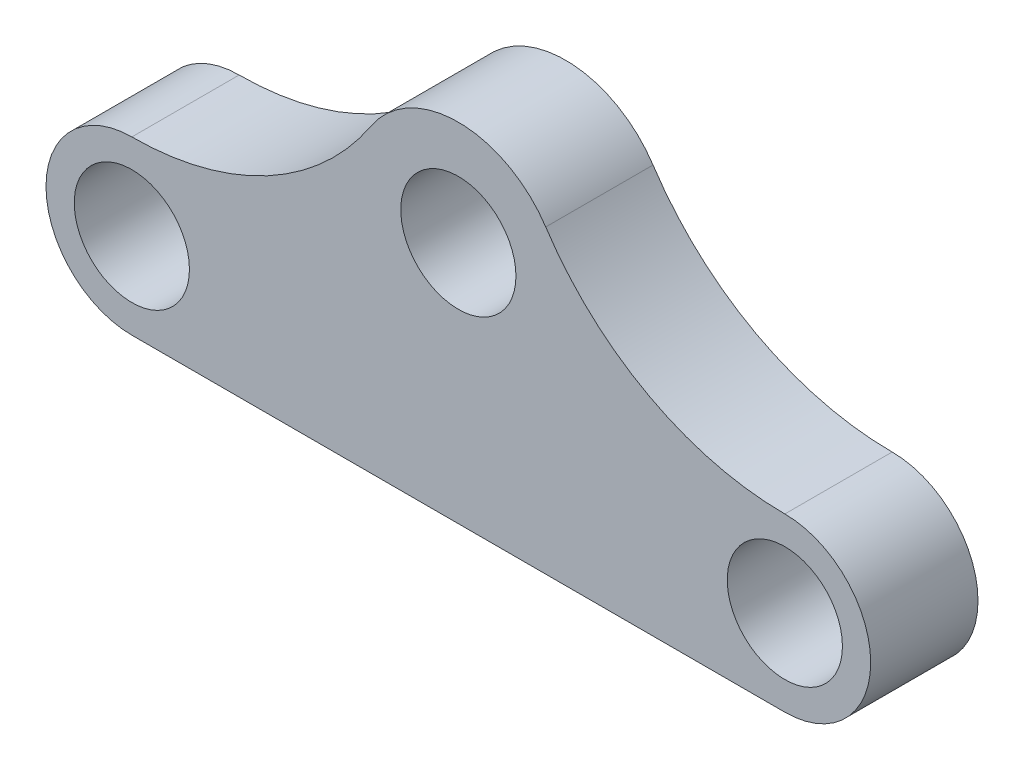
ISO-10303-21;
HEADER;
FILE_DESCRIPTION(('STEP AP214'),'2;1');
FILE_NAME('part.step','',(''),(''),'','','');
FILE_SCHEMA(('AUTOMOTIVE_DESIGN { 1 0 10303 214 1 1 1 1 }'));
ENDSEC;
DATA;
#1=APPLICATION_CONTEXT('core data for automotive mechanical design processes');
#2=APPLICATION_PROTOCOL_DEFINITION('international standard','automotive_design',2000,#1);
#3=PRODUCT_CONTEXT('',#1,'mechanical');
#4=PRODUCT('Part','Part','',(#3));
#5=PRODUCT_RELATED_PRODUCT_CATEGORY('part','',(#4));
#6=PRODUCT_DEFINITION_FORMATION('','',#4);
#7=PRODUCT_DEFINITION_CONTEXT('part definition',#1,'design');
#8=PRODUCT_DEFINITION('design','',#6,#7);
#9=PRODUCT_DEFINITION_SHAPE('','',#8);
#10=(LENGTH_UNIT() NAMED_UNIT(*) SI_UNIT(.MILLI.,.METRE.));
#11=(NAMED_UNIT(*) PLANE_ANGLE_UNIT() SI_UNIT($,.RADIAN.));
#12=(NAMED_UNIT(*) SI_UNIT($,.STERADIAN.) SOLID_ANGLE_UNIT());
#13=UNCERTAINTY_MEASURE_WITH_UNIT(LENGTH_MEASURE(1.E-05),#10,'distance_accuracy_value','');
#14=(GEOMETRIC_REPRESENTATION_CONTEXT(3) GLOBAL_UNCERTAINTY_ASSIGNED_CONTEXT((#13)) GLOBAL_UNIT_ASSIGNED_CONTEXT((#10,
#11,#12)) REPRESENTATION_CONTEXT('',''));
#15=CARTESIAN_POINT('',(0.,0.,0.));
#16=DIRECTION('',(0.,0.,1.));
#17=DIRECTION('',(1.,0.,0.));
#18=AXIS2_PLACEMENT_3D('',#15,#16,#17);
#19=CARTESIAN_POINT('',(22.82,11.,7.5));
#20=DIRECTION('',(0.,0.,-1.));
#21=DIRECTION('',(-1.,0.,0.));
#22=AXIS2_PLACEMENT_3D('',#19,#20,#21);
#23=CYLINDRICAL_SURFACE('',#22,7.30846755129258);
#24=CARTESIAN_POINT('',(22.82,11.,0.));
#25=DIRECTION('',(0.,0.,1.));
#26=DIRECTION('',(1.,0.,0.));
#27=AXIS2_PLACEMENT_3D('',#24,#25,#26);
#28=CIRCLE('',#27,7.30846755129258);
#29=CARTESIAN_POINT('',(16.7127649745545,15.0143963795654,0.));
#30=VERTEX_POINT('',#29);
#31=CARTESIAN_POINT('',(28.9272350254455,15.0143963795654,0.));
#32=VERTEX_POINT('',#31);
#33=EDGE_CURVE('E137',#30,#32,#28,.F.);
#34=ORIENTED_EDGE('',*,*,#33,.F.);
#35=DIRECTION('',(0.,0.,-1.));
#36=VECTOR('',#35,1.);
#37=CARTESIAN_POINT('',(16.7127649745545,15.0143963795654,7.5));
#38=LINE('',#37,#36);
#39=CARTESIAN_POINT('',(16.7127649745545,15.0143963795654,7.5));
#40=VERTEX_POINT('',#39);
#41=EDGE_CURVE('E11',#40,#30,#38,.T.);
#42=ORIENTED_EDGE('',*,*,#41,.F.);
#43=CARTESIAN_POINT('',(22.82,11.,7.5));
#44=DIRECTION('',(0.,0.,1.));
#45=DIRECTION('',(1.,0.,0.));
#46=AXIS2_PLACEMENT_3D('',#43,#44,#45);
#47=CIRCLE('',#46,7.30846755129258);
#48=CARTESIAN_POINT('',(28.9272350254455,15.0143963795654,7.5));
#49=VERTEX_POINT('',#48);
#50=EDGE_CURVE('E201',#40,#49,#47,.F.);
#51=ORIENTED_EDGE('',*,*,#50,.T.);
#52=DIRECTION('',(0.,0.,-1.));
#53=VECTOR('',#52,1.);
#54=CARTESIAN_POINT('',(28.9272350254455,15.0143963795654,7.5));
#55=LINE('',#54,#53);
#56=EDGE_CURVE('E83',#49,#32,#55,.T.);
#57=ORIENTED_EDGE('',*,*,#56,.T.);
#58=EDGE_LOOP('',(#34,#42,#51,#57));
#59=FACE_BOUND('',#58,.T.);
#60=ADVANCED_FACE('F38',(#59),#23,.T.);
#61=CARTESIAN_POINT('',(0.,26.,7.5));
#62=DIRECTION('',(0.,0.,-1.));
#63=DIRECTION('',(-1.,0.,0.));
#64=AXIS2_PLACEMENT_3D('',#61,#62,#63);
#65=CYLINDRICAL_SURFACE('',#64,20.);
#66=CARTESIAN_POINT('',(0.,26.,0.));
#67=DIRECTION('',(0.,0.,1.));
#68=DIRECTION('',(1.,0.,0.));
#69=AXIS2_PLACEMENT_3D('',#66,#67,#68);
#70=CIRCLE('',#69,20.);
#71=CARTESIAN_POINT('',(0.,6.,0.));
#72=VERTEX_POINT('',#71);
#73=EDGE_CURVE('E134',#72,#30,#70,.T.);
#74=ORIENTED_EDGE('',*,*,#73,.F.);
#75=DIRECTION('',(0.,0.,-1.));
#76=VECTOR('',#75,1.);
#77=CARTESIAN_POINT('',(0.,6.,7.5));
#78=LINE('',#77,#76);
#79=CARTESIAN_POINT('',(0.,6.,7.5));
#80=VERTEX_POINT('',#79);
#81=EDGE_CURVE('E47',#80,#72,#78,.T.);
#82=ORIENTED_EDGE('',*,*,#81,.F.);
#83=CARTESIAN_POINT('',(0.,26.,7.5));
#84=DIRECTION('',(0.,0.,1.));
#85=DIRECTION('',(1.,0.,0.));
#86=AXIS2_PLACEMENT_3D('',#83,#84,#85);
#87=CIRCLE('',#86,20.);
#88=EDGE_CURVE('E203',#80,#40,#87,.T.);
#89=ORIENTED_EDGE('',*,*,#88,.T.);
#90=ORIENTED_EDGE('',*,*,#41,.T.);
#91=EDGE_LOOP('',(#74,#82,#89,#90));
#92=FACE_BOUND('',#91,.T.);
#93=ADVANCED_FACE('F136',(#92),#65,.F.);
#94=CARTESIAN_POINT('',(0.,0.,7.5));
#95=DIRECTION('',(0.,0.,-1.));
#96=DIRECTION('',(-1.,0.,0.));
#97=AXIS2_PLACEMENT_3D('',#94,#95,#96);
#98=CYLINDRICAL_SURFACE('',#97,6.);
#99=CARTESIAN_POINT('',(0.,0.,0.));
#100=DIRECTION('',(0.,0.,1.));
#101=DIRECTION('',(1.,0.,0.));
#102=AXIS2_PLACEMENT_3D('',#99,#100,#101);
#103=CIRCLE('',#102,6.);
#104=CARTESIAN_POINT('',(0.,-6.,0.));
#105=VERTEX_POINT('',#104);
#106=EDGE_CURVE('E127',#72,#105,#103,.T.);
#107=ORIENTED_EDGE('',*,*,#106,.T.);
#108=DIRECTION('',(0.,0.,-1.));
#109=VECTOR('',#108,1.);
#110=CARTESIAN_POINT('',(0.,-6.,7.5));
#111=LINE('',#110,#109);
#112=CARTESIAN_POINT('',(0.,-6.,7.5));
#113=VERTEX_POINT('',#112);
#114=EDGE_CURVE('E118',#113,#105,#111,.T.);
#115=ORIENTED_EDGE('',*,*,#114,.F.);
#116=CARTESIAN_POINT('',(0.,0.,7.5));
#117=DIRECTION('',(0.,0.,1.));
#118=DIRECTION('',(1.,0.,0.));
#119=AXIS2_PLACEMENT_3D('',#116,#117,#118);
#120=CIRCLE('',#119,6.);
#121=EDGE_CURVE('E111',#80,#113,#120,.T.);
#122=ORIENTED_EDGE('',*,*,#121,.F.);
#123=ORIENTED_EDGE('',*,*,#81,.T.);
#124=EDGE_LOOP('',(#107,#115,#122,#123));
#125=FACE_BOUND('',#124,.T.);
#126=ADVANCED_FACE('F126',(#125),#98,.T.);
#127=CARTESIAN_POINT('',(0.,-6.,7.5));
#128=DIRECTION('',(0.,1.,0.));
#129=DIRECTION('',(-1.,0.,0.));
#130=AXIS2_PLACEMENT_3D('',#127,#128,#129);
#131=PLANE('',#130);
#132=DIRECTION('',(1.,0.,0.));
#133=VECTOR('',#132,1.);
#134=CARTESIAN_POINT('',(0.,-6.,0.));
#135=LINE('',#134,#133);
#136=CARTESIAN_POINT('',(45.64,-6.,0.));
#137=VERTEX_POINT('',#136);
#138=EDGE_CURVE('E117',#105,#137,#135,.T.);
#139=ORIENTED_EDGE('',*,*,#138,.T.);
#140=DIRECTION('',(0.,0.,-1.));
#141=VECTOR('',#140,1.);
#142=CARTESIAN_POINT('',(45.64,-6.,7.5));
#143=LINE('',#142,#141);
#144=CARTESIAN_POINT('',(45.64,-6.,7.5));
#145=VERTEX_POINT('',#144);
#146=EDGE_CURVE('E101',#145,#137,#143,.T.);
#147=ORIENTED_EDGE('',*,*,#146,.F.);
#148=DIRECTION('',(1.,0.,0.));
#149=VECTOR('',#148,1.);
#150=CARTESIAN_POINT('',(0.,-6.,7.5));
#151=LINE('',#150,#149);
#152=EDGE_CURVE('E104',#113,#145,#151,.T.);
#153=ORIENTED_EDGE('',*,*,#152,.F.);
#154=ORIENTED_EDGE('',*,*,#114,.T.);
#155=EDGE_LOOP('',(#139,#147,#153,#154));
#156=FACE_BOUND('',#155,.T.);
#157=ADVANCED_FACE('F116',(#156),#131,.F.);
#158=CARTESIAN_POINT('',(45.64,0.,7.5));
#159=DIRECTION('',(0.,0.,-1.));
#160=DIRECTION('',(-1.,0.,0.));
#161=AXIS2_PLACEMENT_3D('',#158,#159,#160);
#162=CYLINDRICAL_SURFACE('',#161,6.);
#163=CARTESIAN_POINT('',(45.64,0.,0.));
#164=DIRECTION('',(0.,0.,1.));
#165=DIRECTION('',(1.,0.,0.));
#166=AXIS2_PLACEMENT_3D('',#163,#164,#165);
#167=CIRCLE('',#166,6.);
#168=CARTESIAN_POINT('',(45.64,6.,0.));
#169=VERTEX_POINT('',#168);
#170=EDGE_CURVE('E144',#137,#169,#167,.T.);
#171=ORIENTED_EDGE('',*,*,#170,.T.);
#172=DIRECTION('',(0.,0.,-1.));
#173=VECTOR('',#172,1.);
#174=CARTESIAN_POINT('',(45.64,6.,7.5));
#175=LINE('',#174,#173);
#176=CARTESIAN_POINT('',(45.64,6.,7.5));
#177=VERTEX_POINT('',#176);
#178=EDGE_CURVE('E103',#177,#169,#175,.T.);
#179=ORIENTED_EDGE('',*,*,#178,.F.);
#180=CARTESIAN_POINT('',(45.64,0.,7.5));
#181=DIRECTION('',(0.,0.,1.));
#182=DIRECTION('',(1.,0.,0.));
#183=AXIS2_PLACEMENT_3D('',#180,#181,#182);
#184=CIRCLE('',#183,6.);
#185=EDGE_CURVE('E96',#145,#177,#184,.T.);
#186=ORIENTED_EDGE('',*,*,#185,.F.);
#187=ORIENTED_EDGE('',*,*,#146,.T.);
#188=EDGE_LOOP('',(#171,#179,#186,#187));
#189=FACE_BOUND('',#188,.T.);
#190=ADVANCED_FACE('F99',(#189),#162,.T.);
#191=CARTESIAN_POINT('',(45.64,0.,7.5));
#192=DIRECTION('',(0.,0.,-1.));
#193=DIRECTION('',(-1.,0.,0.));
#194=AXIS2_PLACEMENT_3D('',#191,#192,#193);
#195=CYLINDRICAL_SURFACE('',#194,4.025);
#196=CARTESIAN_POINT('',(45.64,0.,7.5));
#197=DIRECTION('',(0.,0.,1.));
#198=DIRECTION('',(1.,0.,0.));
#199=AXIS2_PLACEMENT_3D('',#196,#197,#198);
#200=CIRCLE('',#199,4.025);
#201=CARTESIAN_POINT('',(49.665,0.,7.5));
#202=VERTEX_POINT('',#201);
#203=EDGE_CURVE('E155',#202,#202,#200,.T.);
#204=ORIENTED_EDGE('',*,*,#203,.T.);
#205=EDGE_LOOP('',(#204));
#206=FACE_BOUND('',#205,.T.);
#207=CARTESIAN_POINT('',(45.64,0.,0.));
#208=DIRECTION('',(0.,0.,1.));
#209=DIRECTION('',(1.,0.,0.));
#210=AXIS2_PLACEMENT_3D('',#207,#208,#209);
#211=CIRCLE('',#210,4.025);
#212=CARTESIAN_POINT('',(49.665,0.,0.));
#213=VERTEX_POINT('',#212);
#214=EDGE_CURVE('E147',#213,#213,#211,.T.);
#215=ORIENTED_EDGE('',*,*,#214,.F.);
#216=EDGE_LOOP('',(#215));
#217=FACE_BOUND('',#216,.T.);
#218=ADVANCED_FACE('F175',(#206,#217),#195,.F.);
#219=CARTESIAN_POINT('',(45.64,26.,7.5));
#220=DIRECTION('',(0.,0.,-1.));
#221=DIRECTION('',(-1.,0.,0.));
#222=AXIS2_PLACEMENT_3D('',#219,#220,#221);
#223=CYLINDRICAL_SURFACE('',#222,20.);
#224=CARTESIAN_POINT('',(45.64,26.,0.));
#225=DIRECTION('',(0.,0.,1.));
#226=DIRECTION('',(1.,0.,0.));
#227=AXIS2_PLACEMENT_3D('',#224,#225,#226);
#228=CIRCLE('',#227,20.);
#229=EDGE_CURVE('E76',#169,#32,#228,.F.);
#230=ORIENTED_EDGE('',*,*,#229,.T.);
#231=ORIENTED_EDGE('',*,*,#56,.F.);
#232=CARTESIAN_POINT('',(45.64,26.,7.5));
#233=DIRECTION('',(0.,0.,1.));
#234=DIRECTION('',(1.,0.,0.));
#235=AXIS2_PLACEMENT_3D('',#232,#233,#234);
#236=CIRCLE('',#235,20.);
#237=EDGE_CURVE('E55',#177,#49,#236,.F.);
#238=ORIENTED_EDGE('',*,*,#237,.F.);
#239=ORIENTED_EDGE('',*,*,#178,.T.);
#240=EDGE_LOOP('',(#230,#231,#238,#239));
#241=FACE_BOUND('',#240,.T.);
#242=ADVANCED_FACE('F168',(#241),#223,.F.);
#243=CARTESIAN_POINT('',(22.82,11.,7.5));
#244=DIRECTION('',(0.,0.,-1.));
#245=DIRECTION('',(-1.,0.,0.));
#246=AXIS2_PLACEMENT_3D('',#243,#244,#245);
#247=CYLINDRICAL_SURFACE('',#246,4.025);
#248=CARTESIAN_POINT('',(22.82,11.,7.5));
#249=DIRECTION('',(0.,0.,1.));
#250=DIRECTION('',(1.,0.,0.));
#251=AXIS2_PLACEMENT_3D('',#248,#249,#250);
#252=CIRCLE('',#251,4.025);
#253=CARTESIAN_POINT('',(26.845,11.,7.5));
#254=VERTEX_POINT('',#253);
#255=EDGE_CURVE('E152',#254,#254,#252,.T.);
#256=ORIENTED_EDGE('',*,*,#255,.T.);
#257=EDGE_LOOP('',(#256));
#258=FACE_BOUND('',#257,.T.);
#259=CARTESIAN_POINT('',(22.82,11.,0.));
#260=DIRECTION('',(0.,0.,1.));
#261=DIRECTION('',(1.,0.,0.));
#262=AXIS2_PLACEMENT_3D('',#259,#260,#261);
#263=CIRCLE('',#262,4.025);
#264=CARTESIAN_POINT('',(26.845,11.,0.));
#265=VERTEX_POINT('',#264);
#266=EDGE_CURVE('E139',#265,#265,#263,.T.);
#267=ORIENTED_EDGE('',*,*,#266,.F.);
#268=EDGE_LOOP('',(#267));
#269=FACE_BOUND('',#268,.T.);
#270=ADVANCED_FACE('F40',(#258,#269),#247,.F.);
#271=CARTESIAN_POINT('',(0.,0.,7.5));
#272=DIRECTION('',(0.,0.,-1.));
#273=DIRECTION('',(-1.,0.,0.));
#274=AXIS2_PLACEMENT_3D('',#271,#272,#273);
#275=CYLINDRICAL_SURFACE('',#274,4.025);
#276=CARTESIAN_POINT('',(0.,0.,7.5));
#277=DIRECTION('',(0.,0.,1.));
#278=DIRECTION('',(1.,0.,0.));
#279=AXIS2_PLACEMENT_3D('',#276,#277,#278);
#280=CIRCLE('',#279,4.025);
#281=CARTESIAN_POINT('',(4.025,0.,7.5));
#282=VERTEX_POINT('',#281);
#283=EDGE_CURVE('E153',#282,#282,#280,.T.);
#284=ORIENTED_EDGE('',*,*,#283,.T.);
#285=EDGE_LOOP('',(#284));
#286=FACE_BOUND('',#285,.T.);
#287=CARTESIAN_POINT('',(0.,0.,0.));
#288=DIRECTION('',(0.,0.,1.));
#289=DIRECTION('',(1.,0.,0.));
#290=AXIS2_PLACEMENT_3D('',#287,#288,#289);
#291=CIRCLE('',#290,4.025);
#292=CARTESIAN_POINT('',(4.025,0.,0.));
#293=VERTEX_POINT('',#292);
#294=EDGE_CURVE('E150',#293,#293,#291,.T.);
#295=ORIENTED_EDGE('',*,*,#294,.F.);
#296=EDGE_LOOP('',(#295));
#297=FACE_BOUND('',#296,.T.);
#298=ADVANCED_FACE('F167',(#286,#297),#275,.F.);
#299=CARTESIAN_POINT('',(0.,0.,7.5));
#300=DIRECTION('',(0.,0.,1.));
#301=DIRECTION('',(1.,0.,0.));
#302=AXIS2_PLACEMENT_3D('',#299,#300,#301);
#303=PLANE('',#302);
#304=ORIENTED_EDGE('',*,*,#255,.F.);
#305=EDGE_LOOP('',(#304));
#306=FACE_BOUND('',#305,.T.);
#307=ORIENTED_EDGE('',*,*,#50,.F.);
#308=ORIENTED_EDGE('',*,*,#88,.F.);
#309=ORIENTED_EDGE('',*,*,#121,.T.);
#310=ORIENTED_EDGE('',*,*,#152,.T.);
#311=ORIENTED_EDGE('',*,*,#185,.T.);
#312=ORIENTED_EDGE('',*,*,#237,.T.);
#313=EDGE_LOOP('',(#307,#308,#309,#310,#311,#312));
#314=FACE_BOUND('',#313,.T.);
#315=ORIENTED_EDGE('',*,*,#203,.F.);
#316=EDGE_LOOP('',(#315));
#317=FACE_BOUND('',#316,.T.);
#318=ORIENTED_EDGE('',*,*,#283,.F.);
#319=EDGE_LOOP('',(#318));
#320=FACE_BOUND('',#319,.T.);
#321=ADVANCED_FACE('F107',(#306,#314,#317,#320),#303,.T.);
#322=CARTESIAN_POINT('',(0.,0.,0.));
#323=DIRECTION('',(0.,0.,1.));
#324=DIRECTION('',(1.,0.,0.));
#325=AXIS2_PLACEMENT_3D('',#322,#323,#324);
#326=PLANE('',#325);
#327=ORIENTED_EDGE('',*,*,#266,.T.);
#328=EDGE_LOOP('',(#327));
#329=FACE_BOUND('',#328,.T.);
#330=ORIENTED_EDGE('',*,*,#33,.T.);
#331=ORIENTED_EDGE('',*,*,#229,.F.);
#332=ORIENTED_EDGE('',*,*,#170,.F.);
#333=ORIENTED_EDGE('',*,*,#138,.F.);
#334=ORIENTED_EDGE('',*,*,#106,.F.);
#335=ORIENTED_EDGE('',*,*,#73,.T.);
#336=EDGE_LOOP('',(#330,#331,#332,#333,#334,#335));
#337=FACE_BOUND('',#336,.T.);
#338=ORIENTED_EDGE('',*,*,#214,.T.);
#339=EDGE_LOOP('',(#338));
#340=FACE_BOUND('',#339,.T.);
#341=ORIENTED_EDGE('',*,*,#294,.T.);
#342=EDGE_LOOP('',(#341));
#343=FACE_BOUND('',#342,.T.);
#344=ADVANCED_FACE('F132',(#329,#337,#340,#343),#326,.F.);
#345=CLOSED_SHELL('',(#60,#93,#126,#157,#190,#218,#242,#270,#298,#321,#344));
#346=MANIFOLD_SOLID_BREP('B2',#345);
#347=ADVANCED_BREP_SHAPE_REPRESENTATION('',(#18,#346),#14);
#348=SHAPE_DEFINITION_REPRESENTATION(#9,#347);
ENDSEC;
END-ISO-10303-21;
